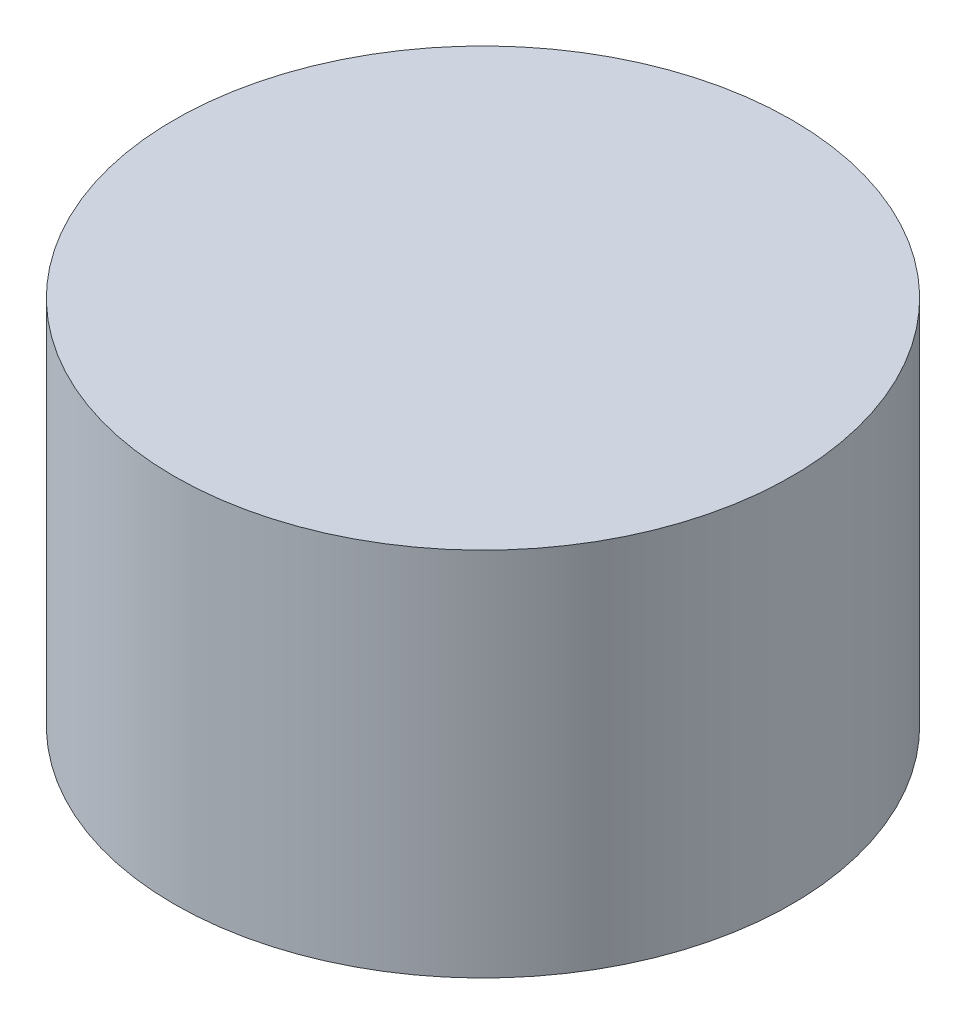
ISO-10303-21;
HEADER;
FILE_DESCRIPTION(('STEP AP214'),'2;1');
FILE_NAME('part.step','',(''),(''),'','','');
FILE_SCHEMA(('AUTOMOTIVE_DESIGN { 1 0 10303 214 1 1 1 1 }'));
ENDSEC;
DATA;
#1=APPLICATION_CONTEXT('core data for automotive mechanical design processes');
#2=APPLICATION_PROTOCOL_DEFINITION('international standard','automotive_design',2000,#1);
#3=PRODUCT_CONTEXT('',#1,'mechanical');
#4=PRODUCT('Part','Part','',(#3));
#5=PRODUCT_RELATED_PRODUCT_CATEGORY('part','',(#4));
#6=PRODUCT_DEFINITION_FORMATION('','',#4);
#7=PRODUCT_DEFINITION_CONTEXT('part definition',#1,'design');
#8=PRODUCT_DEFINITION('design','',#6,#7);
#9=PRODUCT_DEFINITION_SHAPE('','',#8);
#10=(LENGTH_UNIT() NAMED_UNIT(*) SI_UNIT(.MILLI.,.METRE.));
#11=(NAMED_UNIT(*) PLANE_ANGLE_UNIT() SI_UNIT($,.RADIAN.));
#12=(NAMED_UNIT(*) SI_UNIT($,.STERADIAN.) SOLID_ANGLE_UNIT());
#13=UNCERTAINTY_MEASURE_WITH_UNIT(LENGTH_MEASURE(1.E-05),#10,'distance_accuracy_value','');
#14=(GEOMETRIC_REPRESENTATION_CONTEXT(3) GLOBAL_UNCERTAINTY_ASSIGNED_CONTEXT((#13)) GLOBAL_UNIT_ASSIGNED_CONTEXT((#10,
#11,#12)) REPRESENTATION_CONTEXT('',''));
#15=CARTESIAN_POINT('',(0.,0.,0.));
#16=DIRECTION('',(0.,0.,1.));
#17=DIRECTION('',(1.,0.,0.));
#18=AXIS2_PLACEMENT_3D('',#15,#16,#17);
#19=CARTESIAN_POINT('',(0.,0.6,0.));
#20=DIRECTION('',(0.,-1.,0.));
#21=DIRECTION('',(0.,0.,-1.));
#22=AXIS2_PLACEMENT_3D('',#19,#20,#21);
#23=CYLINDRICAL_SURFACE('',#22,0.5);
#24=CARTESIAN_POINT('',(0.,0.6,0.));
#25=DIRECTION('',(0.,1.,0.));
#26=DIRECTION('',(0.,0.,1.));
#27=AXIS2_PLACEMENT_3D('',#24,#25,#26);
#28=CIRCLE('',#27,0.5);
#29=CARTESIAN_POINT('',(0.,0.6,0.5));
#30=VERTEX_POINT('',#29);
#31=EDGE_CURVE('E10',#30,#30,#28,.T.);
#32=ORIENTED_EDGE('',*,*,#31,.F.);
#33=EDGE_LOOP('',(#32));
#34=FACE_BOUND('',#33,.T.);
#35=CARTESIAN_POINT('',(0.,0.,0.));
#36=DIRECTION('',(0.,1.,0.));
#37=DIRECTION('',(0.,0.,1.));
#38=AXIS2_PLACEMENT_3D('',#35,#36,#37);
#39=CIRCLE('',#38,0.5);
#40=CARTESIAN_POINT('',(0.,0.,0.5));
#41=VERTEX_POINT('',#40);
#42=EDGE_CURVE('E34',#41,#41,#39,.T.);
#43=ORIENTED_EDGE('',*,*,#42,.T.);
#44=EDGE_LOOP('',(#43));
#45=FACE_BOUND('',#44,.T.);
#46=ADVANCED_FACE('F28',(#34,#45),#23,.T.);
#47=CARTESIAN_POINT('',(0.,0.6,0.));
#48=DIRECTION('',(0.,1.,0.));
#49=DIRECTION('',(0.,0.,1.));
#50=AXIS2_PLACEMENT_3D('',#47,#48,#49);
#51=PLANE('',#50);
#52=ORIENTED_EDGE('',*,*,#31,.T.);
#53=EDGE_LOOP('',(#52));
#54=FACE_BOUND('',#53,.T.);
#55=ADVANCED_FACE('F43',(#54),#51,.T.);
#56=CARTESIAN_POINT('',(0.,0.,0.));
#57=DIRECTION('',(0.,1.,0.));
#58=DIRECTION('',(0.,0.,1.));
#59=AXIS2_PLACEMENT_3D('',#56,#57,#58);
#60=PLANE('',#59);
#61=ORIENTED_EDGE('',*,*,#42,.F.);
#62=EDGE_LOOP('',(#61));
#63=FACE_BOUND('',#62,.T.);
#64=ADVANCED_FACE('F41',(#63),#60,.F.);
#65=CLOSED_SHELL('',(#46,#55,#64));
#66=MANIFOLD_SOLID_BREP('B2',#65);
#67=ADVANCED_BREP_SHAPE_REPRESENTATION('',(#18,#66),#14);
#68=SHAPE_DEFINITION_REPRESENTATION(#9,#67);
ENDSEC;
END-ISO-10303-21;
